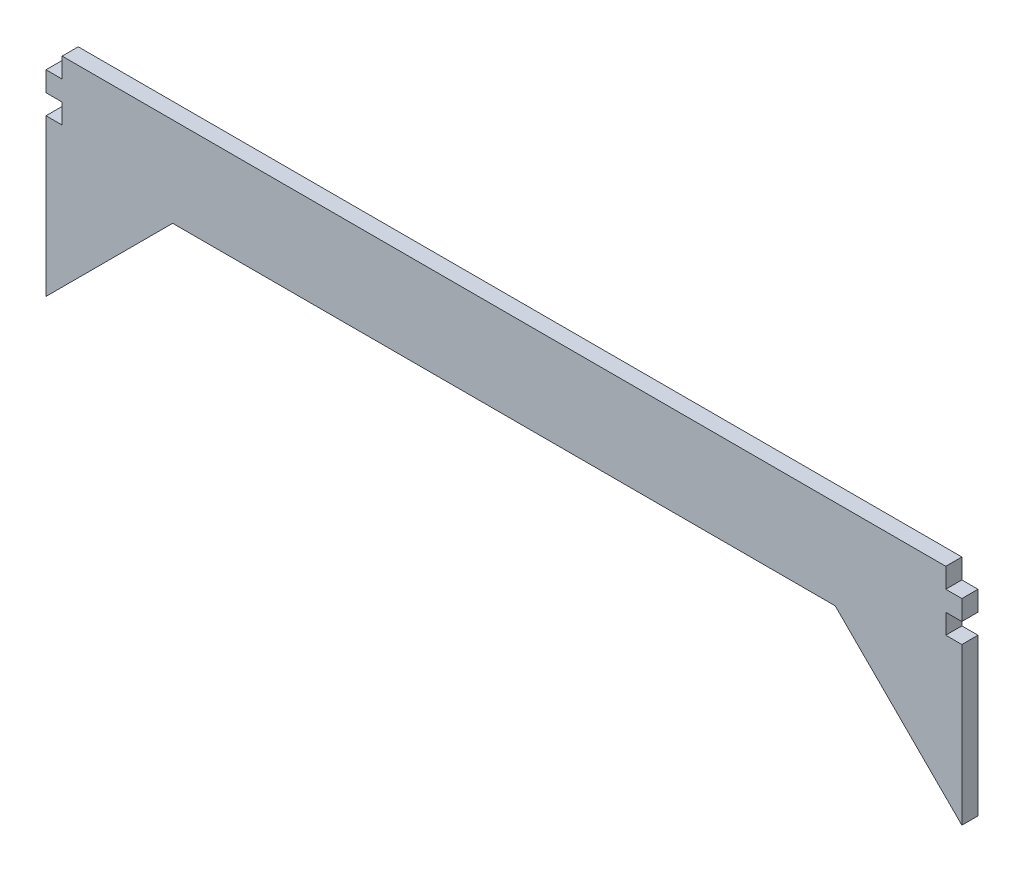
ISO-10303-21;
HEADER;
FILE_DESCRIPTION(('STEP AP214'),'2;1');
FILE_NAME('part.step','',(''),(''),'','','');
FILE_SCHEMA(('AUTOMOTIVE_DESIGN { 1 0 10303 214 1 1 1 1 }'));
ENDSEC;
DATA;
#1=APPLICATION_CONTEXT('core data for automotive mechanical design processes');
#2=APPLICATION_PROTOCOL_DEFINITION('international standard','automotive_design',2000,#1);
#3=PRODUCT_CONTEXT('',#1,'mechanical');
#4=PRODUCT('Part','Part','',(#3));
#5=PRODUCT_RELATED_PRODUCT_CATEGORY('part','',(#4));
#6=PRODUCT_DEFINITION_FORMATION('','',#4);
#7=PRODUCT_DEFINITION_CONTEXT('part definition',#1,'design');
#8=PRODUCT_DEFINITION('design','',#6,#7);
#9=PRODUCT_DEFINITION_SHAPE('','',#8);
#10=(LENGTH_UNIT() NAMED_UNIT(*) SI_UNIT(.MILLI.,.METRE.));
#11=(NAMED_UNIT(*) PLANE_ANGLE_UNIT() SI_UNIT($,.RADIAN.));
#12=(NAMED_UNIT(*) SI_UNIT($,.STERADIAN.) SOLID_ANGLE_UNIT());
#13=UNCERTAINTY_MEASURE_WITH_UNIT(LENGTH_MEASURE(1.E-05),#10,'distance_accuracy_value','');
#14=(GEOMETRIC_REPRESENTATION_CONTEXT(3) GLOBAL_UNCERTAINTY_ASSIGNED_CONTEXT((#13)) GLOBAL_UNIT_ASSIGNED_CONTEXT((#10,
#11,#12)) REPRESENTATION_CONTEXT('',''));
#15=CARTESIAN_POINT('',(0.,0.,0.));
#16=DIRECTION('',(0.,0.,1.));
#17=DIRECTION('',(1.,0.,0.));
#18=AXIS2_PLACEMENT_3D('',#15,#16,#17);
#19=CARTESIAN_POINT('',(76.7,-10.,2.7));
#20=DIRECTION('',(-1.,0.,0.));
#21=DIRECTION('',(0.,0.,1.));
#22=AXIS2_PLACEMENT_3D('',#19,#20,#21);
#23=PLANE('',#22);
#24=DIRECTION('',(0.,1.,0.));
#25=VECTOR('',#24,1.);
#26=CARTESIAN_POINT('',(76.7,-10.,0.));
#27=LINE('',#26,#25);
#28=CARTESIAN_POINT('',(76.7,-31.2132034355964,0.));
#29=VERTEX_POINT('',#28);
#30=CARTESIAN_POINT('',(76.7,-5.,0.));
#31=VERTEX_POINT('',#30);
#32=EDGE_CURVE('E115',#29,#31,#27,.T.);
#33=ORIENTED_EDGE('',*,*,#32,.T.);
#34=DIRECTION('',(0.,0.,-1.));
#35=VECTOR('',#34,1.);
#36=CARTESIAN_POINT('',(76.7,-5.,2.7));
#37=LINE('',#36,#35);
#38=CARTESIAN_POINT('',(76.7,-5.,2.7));
#39=VERTEX_POINT('',#38);
#40=EDGE_CURVE('E11',#39,#31,#37,.T.);
#41=ORIENTED_EDGE('',*,*,#40,.F.);
#42=DIRECTION('',(0.,1.,0.));
#43=VECTOR('',#42,1.);
#44=CARTESIAN_POINT('',(76.7,-31.2132034355964,2.7));
#45=LINE('',#44,#43);
#46=CARTESIAN_POINT('',(76.7,-31.2132034355964,2.7));
#47=VERTEX_POINT('',#46);
#48=EDGE_CURVE('E121',#47,#39,#45,.T.);
#49=ORIENTED_EDGE('',*,*,#48,.F.);
#50=DIRECTION('',(0.,0.,-1.));
#51=VECTOR('',#50,1.);
#52=CARTESIAN_POINT('',(76.7,-31.2132034355964,2.7));
#53=LINE('',#52,#51);
#54=EDGE_CURVE('E185',#47,#29,#53,.T.);
#55=ORIENTED_EDGE('',*,*,#54,.T.);
#56=EDGE_LOOP('',(#33,#41,#49,#55));
#57=FACE_BOUND('',#56,.T.);
#58=ADVANCED_FACE('F33',(#57),#23,.F.);
#59=CARTESIAN_POINT('',(76.7,-5.,2.7));
#60=DIRECTION('',(0.,-1.,0.));
#61=DIRECTION('',(0.,0.,-1.));
#62=AXIS2_PLACEMENT_3D('',#59,#60,#61);
#63=PLANE('',#62);
#64=DIRECTION('',(-1.,0.,0.));
#65=VECTOR('',#64,1.);
#66=CARTESIAN_POINT('',(76.7,-5.,0.));
#67=LINE('',#66,#65);
#68=CARTESIAN_POINT('',(74.,-5.,0.));
#69=VERTEX_POINT('',#68);
#70=EDGE_CURVE('E190',#31,#69,#67,.T.);
#71=ORIENTED_EDGE('',*,*,#70,.T.);
#72=DIRECTION('',(0.,0.,-1.));
#73=VECTOR('',#72,1.);
#74=CARTESIAN_POINT('',(74.,-5.,2.7));
#75=LINE('',#74,#73);
#76=CARTESIAN_POINT('',(74.,-5.,2.7));
#77=VERTEX_POINT('',#76);
#78=EDGE_CURVE('E41',#77,#69,#75,.T.);
#79=ORIENTED_EDGE('',*,*,#78,.F.);
#80=DIRECTION('',(-1.,0.,0.));
#81=VECTOR('',#80,1.);
#82=CARTESIAN_POINT('',(76.7,-5.,2.7));
#83=LINE('',#82,#81);
#84=EDGE_CURVE('E320',#39,#77,#83,.T.);
#85=ORIENTED_EDGE('',*,*,#84,.F.);
#86=ORIENTED_EDGE('',*,*,#40,.T.);
#87=EDGE_LOOP('',(#71,#79,#85,#86));
#88=FACE_BOUND('',#87,.T.);
#89=ADVANCED_FACE('F323',(#88),#63,.F.);
#90=CARTESIAN_POINT('',(74.,-1.66666666666667,2.7));
#91=DIRECTION('',(-1.,0.,0.));
#92=DIRECTION('',(0.,0.,1.));
#93=AXIS2_PLACEMENT_3D('',#90,#91,#92);
#94=PLANE('',#93);
#95=DIRECTION('',(0.,1.,0.));
#96=VECTOR('',#95,1.);
#97=CARTESIAN_POINT('',(74.,-1.66666666666667,0.));
#98=LINE('',#97,#96);
#99=CARTESIAN_POINT('',(74.,-1.66666666666667,0.));
#100=VERTEX_POINT('',#99);
#101=EDGE_CURVE('E192',#69,#100,#98,.T.);
#102=ORIENTED_EDGE('',*,*,#101,.T.);
#103=DIRECTION('',(0.,0.,-1.));
#104=VECTOR('',#103,1.);
#105=CARTESIAN_POINT('',(74.,-1.66666666666667,2.7));
#106=LINE('',#105,#104);
#107=CARTESIAN_POINT('',(74.,-1.66666666666667,2.7));
#108=VERTEX_POINT('',#107);
#109=EDGE_CURVE('E260',#108,#100,#106,.T.);
#110=ORIENTED_EDGE('',*,*,#109,.F.);
#111=DIRECTION('',(0.,1.,0.));
#112=VECTOR('',#111,1.);
#113=CARTESIAN_POINT('',(74.,-1.66666666666667,2.7));
#114=LINE('',#113,#112);
#115=EDGE_CURVE('E269',#77,#108,#114,.T.);
#116=ORIENTED_EDGE('',*,*,#115,.F.);
#117=ORIENTED_EDGE('',*,*,#78,.T.);
#118=EDGE_LOOP('',(#102,#110,#116,#117));
#119=FACE_BOUND('',#118,.T.);
#120=ADVANCED_FACE('F267',(#119),#94,.F.);
#121=CARTESIAN_POINT('',(76.7,-1.66666666666667,2.7));
#122=DIRECTION('',(0.,1.,0.));
#123=DIRECTION('',(-1.,0.,0.));
#124=AXIS2_PLACEMENT_3D('',#121,#122,#123);
#125=PLANE('',#124);
#126=DIRECTION('',(1.,0.,0.));
#127=VECTOR('',#126,1.);
#128=CARTESIAN_POINT('',(76.7,-1.66666666666667,0.));
#129=LINE('',#128,#127);
#130=CARTESIAN_POINT('',(76.7,-1.66666666666667,0.));
#131=VERTEX_POINT('',#130);
#132=EDGE_CURVE('E194',#100,#131,#129,.T.);
#133=ORIENTED_EDGE('',*,*,#132,.T.);
#134=DIRECTION('',(0.,0.,-1.));
#135=VECTOR('',#134,1.);
#136=CARTESIAN_POINT('',(76.7,-1.66666666666667,2.7));
#137=LINE('',#136,#135);
#138=CARTESIAN_POINT('',(76.7,-1.66666666666667,2.7));
#139=VERTEX_POINT('',#138);
#140=EDGE_CURVE('E257',#139,#131,#137,.T.);
#141=ORIENTED_EDGE('',*,*,#140,.F.);
#142=DIRECTION('',(1.,0.,0.));
#143=VECTOR('',#142,1.);
#144=CARTESIAN_POINT('',(76.7,-1.66666666666667,2.7));
#145=LINE('',#144,#143);
#146=EDGE_CURVE('E287',#108,#139,#145,.T.);
#147=ORIENTED_EDGE('',*,*,#146,.F.);
#148=ORIENTED_EDGE('',*,*,#109,.T.);
#149=EDGE_LOOP('',(#133,#141,#147,#148));
#150=FACE_BOUND('',#149,.T.);
#151=ADVANCED_FACE('F278',(#150),#125,.F.);
#152=CARTESIAN_POINT('',(76.7,-1.66666666666667,2.7));
#153=DIRECTION('',(-1.,0.,0.));
#154=DIRECTION('',(0.,0.,1.));
#155=AXIS2_PLACEMENT_3D('',#152,#153,#154);
#156=PLANE('',#155);
#157=DIRECTION('',(0.,1.,0.));
#158=VECTOR('',#157,1.);
#159=CARTESIAN_POINT('',(76.7,-1.66666666666667,0.));
#160=LINE('',#159,#158);
#161=CARTESIAN_POINT('',(76.7,1.66666666666667,0.));
#162=VERTEX_POINT('',#161);
#163=EDGE_CURVE('E196',#131,#162,#160,.T.);
#164=ORIENTED_EDGE('',*,*,#163,.T.);
#165=DIRECTION('',(0.,0.,-1.));
#166=VECTOR('',#165,1.);
#167=CARTESIAN_POINT('',(76.7,1.66666666666667,2.7));
#168=LINE('',#167,#166);
#169=CARTESIAN_POINT('',(76.7,1.66666666666667,2.7));
#170=VERTEX_POINT('',#169);
#171=EDGE_CURVE('E254',#170,#162,#168,.T.);
#172=ORIENTED_EDGE('',*,*,#171,.F.);
#173=DIRECTION('',(0.,1.,0.));
#174=VECTOR('',#173,1.);
#175=CARTESIAN_POINT('',(76.7,-1.66666666666667,2.7));
#176=LINE('',#175,#174);
#177=EDGE_CURVE('E284',#139,#170,#176,.T.);
#178=ORIENTED_EDGE('',*,*,#177,.F.);
#179=ORIENTED_EDGE('',*,*,#140,.T.);
#180=EDGE_LOOP('',(#164,#172,#178,#179));
#181=FACE_BOUND('',#180,.T.);
#182=ADVANCED_FACE('F282',(#181),#156,.F.);
#183=CARTESIAN_POINT('',(76.7,1.66666666666667,2.7));
#184=DIRECTION('',(0.,-1.,0.));
#185=DIRECTION('',(1.,0.,0.));
#186=AXIS2_PLACEMENT_3D('',#183,#184,#185);
#187=PLANE('',#186);
#188=DIRECTION('',(-1.,0.,0.));
#189=VECTOR('',#188,1.);
#190=CARTESIAN_POINT('',(76.7,1.66666666666667,0.));
#191=LINE('',#190,#189);
#192=CARTESIAN_POINT('',(74.,1.66666666666667,0.));
#193=VERTEX_POINT('',#192);
#194=EDGE_CURVE('E198',#162,#193,#191,.T.);
#195=ORIENTED_EDGE('',*,*,#194,.T.);
#196=DIRECTION('',(0.,0.,-1.));
#197=VECTOR('',#196,1.);
#198=CARTESIAN_POINT('',(74.,1.66666666666667,2.7));
#199=LINE('',#198,#197);
#200=CARTESIAN_POINT('',(74.,1.66666666666667,2.7));
#201=VERTEX_POINT('',#200);
#202=EDGE_CURVE('E251',#201,#193,#199,.T.);
#203=ORIENTED_EDGE('',*,*,#202,.F.);
#204=DIRECTION('',(-1.,0.,0.));
#205=VECTOR('',#204,1.);
#206=CARTESIAN_POINT('',(76.7,1.66666666666667,2.7));
#207=LINE('',#206,#205);
#208=EDGE_CURVE('E286',#170,#201,#207,.T.);
#209=ORIENTED_EDGE('',*,*,#208,.F.);
#210=ORIENTED_EDGE('',*,*,#171,.T.);
#211=EDGE_LOOP('',(#195,#203,#209,#210));
#212=FACE_BOUND('',#211,.T.);
#213=ADVANCED_FACE('F335',(#212),#187,.F.);
#214=CARTESIAN_POINT('',(74.,1.66666666666667,2.7));
#215=DIRECTION('',(-1.,0.,0.));
#216=DIRECTION('',(0.,0.,1.));
#217=AXIS2_PLACEMENT_3D('',#214,#215,#216);
#218=PLANE('',#217);
#219=DIRECTION('',(0.,1.,0.));
#220=VECTOR('',#219,1.);
#221=CARTESIAN_POINT('',(74.,1.66666666666667,0.));
#222=LINE('',#221,#220);
#223=CARTESIAN_POINT('',(74.,5.,0.));
#224=VERTEX_POINT('',#223);
#225=EDGE_CURVE('E200',#193,#224,#222,.T.);
#226=ORIENTED_EDGE('',*,*,#225,.T.);
#227=DIRECTION('',(0.,0.,-1.));
#228=VECTOR('',#227,1.);
#229=CARTESIAN_POINT('',(74.,5.,2.7));
#230=LINE('',#229,#228);
#231=CARTESIAN_POINT('',(74.,5.,2.7));
#232=VERTEX_POINT('',#231);
#233=EDGE_CURVE('E248',#232,#224,#230,.T.);
#234=ORIENTED_EDGE('',*,*,#233,.F.);
#235=DIRECTION('',(0.,1.,0.));
#236=VECTOR('',#235,1.);
#237=CARTESIAN_POINT('',(74.,1.66666666666667,2.7));
#238=LINE('',#237,#236);
#239=EDGE_CURVE('E289',#201,#232,#238,.T.);
#240=ORIENTED_EDGE('',*,*,#239,.F.);
#241=ORIENTED_EDGE('',*,*,#202,.T.);
#242=EDGE_LOOP('',(#226,#234,#240,#241));
#243=FACE_BOUND('',#242,.T.);
#244=ADVANCED_FACE('F338',(#243),#218,.F.);
#245=CARTESIAN_POINT('',(74.,5.,2.7));
#246=DIRECTION('',(0.,-1.,0.));
#247=DIRECTION('',(1.,0.,0.));
#248=AXIS2_PLACEMENT_3D('',#245,#246,#247);
#249=PLANE('',#248);
#250=DIRECTION('',(-1.,0.,0.));
#251=VECTOR('',#250,1.);
#252=CARTESIAN_POINT('',(74.,5.,0.));
#253=LINE('',#252,#251);
#254=CARTESIAN_POINT('',(-74.,4.99999999999999,0.));
#255=VERTEX_POINT('',#254);
#256=EDGE_CURVE('E202',#224,#255,#253,.T.);
#257=ORIENTED_EDGE('',*,*,#256,.T.);
#258=DIRECTION('',(0.,0.,-1.));
#259=VECTOR('',#258,1.);
#260=CARTESIAN_POINT('',(-74.,4.99999999999999,2.7));
#261=LINE('',#260,#259);
#262=CARTESIAN_POINT('',(-74.,4.99999999999999,2.7));
#263=VERTEX_POINT('',#262);
#264=EDGE_CURVE('E245',#263,#255,#261,.T.);
#265=ORIENTED_EDGE('',*,*,#264,.F.);
#266=DIRECTION('',(-1.,0.,0.));
#267=VECTOR('',#266,1.);
#268=CARTESIAN_POINT('',(74.,5.,2.7));
#269=LINE('',#268,#267);
#270=EDGE_CURVE('E295',#232,#263,#269,.T.);
#271=ORIENTED_EDGE('',*,*,#270,.F.);
#272=ORIENTED_EDGE('',*,*,#233,.T.);
#273=EDGE_LOOP('',(#257,#265,#271,#272));
#274=FACE_BOUND('',#273,.T.);
#275=ADVANCED_FACE('F342',(#274),#249,.F.);
#276=CARTESIAN_POINT('',(-74.,1.66666666666665,2.7));
#277=DIRECTION('',(1.,0.,0.));
#278=DIRECTION('',(0.,0.,-1.));
#279=AXIS2_PLACEMENT_3D('',#276,#277,#278);
#280=PLANE('',#279);
#281=DIRECTION('',(0.,-1.,0.));
#282=VECTOR('',#281,1.);
#283=CARTESIAN_POINT('',(-74.,1.66666666666665,0.));
#284=LINE('',#283,#282);
#285=CARTESIAN_POINT('',(-74.,1.66666666666665,0.));
#286=VERTEX_POINT('',#285);
#287=EDGE_CURVE('E204',#255,#286,#284,.T.);
#288=ORIENTED_EDGE('',*,*,#287,.T.);
#289=DIRECTION('',(0.,0.,-1.));
#290=VECTOR('',#289,1.);
#291=CARTESIAN_POINT('',(-74.,1.66666666666665,2.7));
#292=LINE('',#291,#290);
#293=CARTESIAN_POINT('',(-74.,1.66666666666665,2.7));
#294=VERTEX_POINT('',#293);
#295=EDGE_CURVE('E242',#294,#286,#292,.T.);
#296=ORIENTED_EDGE('',*,*,#295,.F.);
#297=DIRECTION('',(0.,-1.,0.));
#298=VECTOR('',#297,1.);
#299=CARTESIAN_POINT('',(-74.,1.66666666666665,2.7));
#300=LINE('',#299,#298);
#301=EDGE_CURVE('E297',#263,#294,#300,.T.);
#302=ORIENTED_EDGE('',*,*,#301,.F.);
#303=ORIENTED_EDGE('',*,*,#264,.T.);
#304=EDGE_LOOP('',(#288,#296,#302,#303));
#305=FACE_BOUND('',#304,.T.);
#306=ADVANCED_FACE('F346',(#305),#280,.F.);
#307=CARTESIAN_POINT('',(-76.7,1.66666666666665,2.7));
#308=DIRECTION('',(0.,-1.,0.));
#309=DIRECTION('',(1.,0.,0.));
#310=AXIS2_PLACEMENT_3D('',#307,#308,#309);
#311=PLANE('',#310);
#312=DIRECTION('',(-1.,0.,0.));
#313=VECTOR('',#312,1.);
#314=CARTESIAN_POINT('',(-76.7,1.66666666666665,0.));
#315=LINE('',#314,#313);
#316=CARTESIAN_POINT('',(-76.7,1.66666666666665,0.));
#317=VERTEX_POINT('',#316);
#318=EDGE_CURVE('E206',#286,#317,#315,.T.);
#319=ORIENTED_EDGE('',*,*,#318,.T.);
#320=DIRECTION('',(0.,0.,-1.));
#321=VECTOR('',#320,1.);
#322=CARTESIAN_POINT('',(-76.7,1.66666666666665,2.7));
#323=LINE('',#322,#321);
#324=CARTESIAN_POINT('',(-76.7,1.66666666666665,2.7));
#325=VERTEX_POINT('',#324);
#326=EDGE_CURVE('E239',#325,#317,#323,.T.);
#327=ORIENTED_EDGE('',*,*,#326,.F.);
#328=DIRECTION('',(-1.,0.,0.));
#329=VECTOR('',#328,1.);
#330=CARTESIAN_POINT('',(-76.7,1.66666666666665,2.7));
#331=LINE('',#330,#329);
#332=EDGE_CURVE('E299',#294,#325,#331,.T.);
#333=ORIENTED_EDGE('',*,*,#332,.F.);
#334=ORIENTED_EDGE('',*,*,#295,.T.);
#335=EDGE_LOOP('',(#319,#327,#333,#334));
#336=FACE_BOUND('',#335,.T.);
#337=ADVANCED_FACE('F350',(#336),#311,.F.);
#338=CARTESIAN_POINT('',(-76.7,-1.66666666666668,2.7));
#339=DIRECTION('',(1.,0.,0.));
#340=DIRECTION('',(0.,0.,-1.));
#341=AXIS2_PLACEMENT_3D('',#338,#339,#340);
#342=PLANE('',#341);
#343=DIRECTION('',(0.,-1.,0.));
#344=VECTOR('',#343,1.);
#345=CARTESIAN_POINT('',(-76.7,-1.66666666666668,0.));
#346=LINE('',#345,#344);
#347=CARTESIAN_POINT('',(-76.7,-1.66666666666668,0.));
#348=VERTEX_POINT('',#347);
#349=EDGE_CURVE('E208',#317,#348,#346,.T.);
#350=ORIENTED_EDGE('',*,*,#349,.T.);
#351=DIRECTION('',(0.,0.,-1.));
#352=VECTOR('',#351,1.);
#353=CARTESIAN_POINT('',(-76.7,-1.66666666666668,2.7));
#354=LINE('',#353,#352);
#355=CARTESIAN_POINT('',(-76.7,-1.66666666666668,2.7));
#356=VERTEX_POINT('',#355);
#357=EDGE_CURVE('E236',#356,#348,#354,.T.);
#358=ORIENTED_EDGE('',*,*,#357,.F.);
#359=DIRECTION('',(0.,-1.,0.));
#360=VECTOR('',#359,1.);
#361=CARTESIAN_POINT('',(-76.7,-1.66666666666668,2.7));
#362=LINE('',#361,#360);
#363=EDGE_CURVE('E301',#325,#356,#362,.T.);
#364=ORIENTED_EDGE('',*,*,#363,.F.);
#365=ORIENTED_EDGE('',*,*,#326,.T.);
#366=EDGE_LOOP('',(#350,#358,#364,#365));
#367=FACE_BOUND('',#366,.T.);
#368=ADVANCED_FACE('F354',(#367),#342,.F.);
#369=CARTESIAN_POINT('',(-76.7,-1.66666666666668,2.7));
#370=DIRECTION('',(0.,1.,0.));
#371=DIRECTION('',(0.,0.,1.));
#372=AXIS2_PLACEMENT_3D('',#369,#370,#371);
#373=PLANE('',#372);
#374=DIRECTION('',(1.,0.,0.));
#375=VECTOR('',#374,1.);
#376=CARTESIAN_POINT('',(-76.7,-1.66666666666668,0.));
#377=LINE('',#376,#375);
#378=CARTESIAN_POINT('',(-74.,-1.66666666666668,0.));
#379=VERTEX_POINT('',#378);
#380=EDGE_CURVE('E210',#348,#379,#377,.T.);
#381=ORIENTED_EDGE('',*,*,#380,.T.);
#382=DIRECTION('',(0.,0.,-1.));
#383=VECTOR('',#382,1.);
#384=CARTESIAN_POINT('',(-74.,-1.66666666666668,2.7));
#385=LINE('',#384,#383);
#386=CARTESIAN_POINT('',(-74.,-1.66666666666668,2.7));
#387=VERTEX_POINT('',#386);
#388=EDGE_CURVE('E233',#387,#379,#385,.T.);
#389=ORIENTED_EDGE('',*,*,#388,.F.);
#390=DIRECTION('',(1.,0.,0.));
#391=VECTOR('',#390,1.);
#392=CARTESIAN_POINT('',(-76.7,-1.66666666666668,2.7));
#393=LINE('',#392,#391);
#394=EDGE_CURVE('E303',#356,#387,#393,.T.);
#395=ORIENTED_EDGE('',*,*,#394,.F.);
#396=ORIENTED_EDGE('',*,*,#357,.T.);
#397=EDGE_LOOP('',(#381,#389,#395,#396));
#398=FACE_BOUND('',#397,.T.);
#399=ADVANCED_FACE('F358',(#398),#373,.F.);
#400=CARTESIAN_POINT('',(-74.,-1.66666666666668,2.7));
#401=DIRECTION('',(1.,0.,0.));
#402=DIRECTION('',(0.,0.,-1.));
#403=AXIS2_PLACEMENT_3D('',#400,#401,#402);
#404=PLANE('',#403);
#405=DIRECTION('',(0.,-1.,0.));
#406=VECTOR('',#405,1.);
#407=CARTESIAN_POINT('',(-74.,-1.66666666666668,0.));
#408=LINE('',#407,#406);
#409=CARTESIAN_POINT('',(-74.,-5.00000000000002,0.));
#410=VERTEX_POINT('',#409);
#411=EDGE_CURVE('E212',#379,#410,#408,.T.);
#412=ORIENTED_EDGE('',*,*,#411,.T.);
#413=DIRECTION('',(0.,0.,-1.));
#414=VECTOR('',#413,1.);
#415=CARTESIAN_POINT('',(-74.,-5.00000000000002,2.7));
#416=LINE('',#415,#414);
#417=CARTESIAN_POINT('',(-74.,-5.00000000000002,2.7));
#418=VERTEX_POINT('',#417);
#419=EDGE_CURVE('E230',#418,#410,#416,.T.);
#420=ORIENTED_EDGE('',*,*,#419,.F.);
#421=DIRECTION('',(0.,-1.,0.));
#422=VECTOR('',#421,1.);
#423=CARTESIAN_POINT('',(-74.,-1.66666666666668,2.7));
#424=LINE('',#423,#422);
#425=EDGE_CURVE('E305',#387,#418,#424,.T.);
#426=ORIENTED_EDGE('',*,*,#425,.F.);
#427=ORIENTED_EDGE('',*,*,#388,.T.);
#428=EDGE_LOOP('',(#412,#420,#426,#427));
#429=FACE_BOUND('',#428,.T.);
#430=ADVANCED_FACE('F362',(#429),#404,.F.);
#431=CARTESIAN_POINT('',(-74.,-5.00000000000002,2.7));
#432=DIRECTION('',(0.,-1.,0.));
#433=DIRECTION('',(0.,0.,-1.));
#434=AXIS2_PLACEMENT_3D('',#431,#432,#433);
#435=PLANE('',#434);
#436=DIRECTION('',(-1.,0.,0.));
#437=VECTOR('',#436,1.);
#438=CARTESIAN_POINT('',(-74.,-5.00000000000002,0.));
#439=LINE('',#438,#437);
#440=CARTESIAN_POINT('',(-76.7,-5.00000000000002,0.));
#441=VERTEX_POINT('',#440);
#442=EDGE_CURVE('E214',#410,#441,#439,.T.);
#443=ORIENTED_EDGE('',*,*,#442,.T.);
#444=DIRECTION('',(0.,0.,-1.));
#445=VECTOR('',#444,1.);
#446=CARTESIAN_POINT('',(-76.7,-5.00000000000002,2.7));
#447=LINE('',#446,#445);
#448=CARTESIAN_POINT('',(-76.7,-5.00000000000002,2.7));
#449=VERTEX_POINT('',#448);
#450=EDGE_CURVE('E227',#449,#441,#447,.T.);
#451=ORIENTED_EDGE('',*,*,#450,.F.);
#452=DIRECTION('',(-1.,0.,0.));
#453=VECTOR('',#452,1.);
#454=CARTESIAN_POINT('',(-74.,-5.00000000000002,2.7));
#455=LINE('',#454,#453);
#456=EDGE_CURVE('E307',#418,#449,#455,.T.);
#457=ORIENTED_EDGE('',*,*,#456,.F.);
#458=ORIENTED_EDGE('',*,*,#419,.T.);
#459=EDGE_LOOP('',(#443,#451,#457,#458));
#460=FACE_BOUND('',#459,.T.);
#461=ADVANCED_FACE('F313',(#460),#435,.F.);
#462=CARTESIAN_POINT('',(-76.7,-31.2132034355964,2.7));
#463=DIRECTION('',(1.,0.,0.));
#464=DIRECTION('',(0.,1.,0.));
#465=AXIS2_PLACEMENT_3D('',#462,#463,#464);
#466=PLANE('',#465);
#467=DIRECTION('',(0.,-1.,0.));
#468=VECTOR('',#467,1.);
#469=CARTESIAN_POINT('',(-76.7,-31.2132034355964,0.));
#470=LINE('',#469,#468);
#471=CARTESIAN_POINT('',(-76.7,-31.2132034355964,0.));
#472=VERTEX_POINT('',#471);
#473=EDGE_CURVE('E217',#441,#472,#470,.T.);
#474=ORIENTED_EDGE('',*,*,#473,.T.);
#475=DIRECTION('',(0.,0.,-1.));
#476=VECTOR('',#475,1.);
#477=CARTESIAN_POINT('',(-76.7,-31.2132034355964,2.7));
#478=LINE('',#477,#476);
#479=CARTESIAN_POINT('',(-76.7,-31.2132034355964,2.7));
#480=VERTEX_POINT('',#479);
#481=EDGE_CURVE('E180',#480,#472,#478,.T.);
#482=ORIENTED_EDGE('',*,*,#481,.F.);
#483=DIRECTION('',(0.,-1.,0.));
#484=VECTOR('',#483,1.);
#485=CARTESIAN_POINT('',(-76.7,-5.00000000000002,2.7));
#486=LINE('',#485,#484);
#487=EDGE_CURVE('E171',#449,#480,#486,.T.);
#488=ORIENTED_EDGE('',*,*,#487,.F.);
#489=ORIENTED_EDGE('',*,*,#450,.T.);
#490=EDGE_LOOP('',(#474,#482,#488,#489));
#491=FACE_BOUND('',#490,.T.);
#492=ADVANCED_FACE('F316',(#491),#466,.F.);
#493=CARTESIAN_POINT('',(-55.4867965644036,-10.,2.7));
#494=DIRECTION('',(-0.707106781186547,0.707106781186548,0.));
#495=DIRECTION('',(-0.707106781186548,-0.707106781186547,0.));
#496=AXIS2_PLACEMENT_3D('',#493,#494,#495);
#497=PLANE('',#496);
#498=DIRECTION('',(0.707106781186548,0.707106781186547,0.));
#499=VECTOR('',#498,1.);
#500=CARTESIAN_POINT('',(-55.4867965644036,-10.,0.));
#501=LINE('',#500,#499);
#502=CARTESIAN_POINT('',(-55.4867965644036,-10.,0.));
#503=VERTEX_POINT('',#502);
#504=EDGE_CURVE('E179',#472,#503,#501,.T.);
#505=ORIENTED_EDGE('',*,*,#504,.T.);
#506=DIRECTION('',(0.,0.,-1.));
#507=VECTOR('',#506,1.);
#508=CARTESIAN_POINT('',(-55.4867965644036,-10.,2.7));
#509=LINE('',#508,#507);
#510=CARTESIAN_POINT('',(-55.4867965644036,-10.,2.7));
#511=VERTEX_POINT('',#510);
#512=EDGE_CURVE('E176',#511,#503,#509,.T.);
#513=ORIENTED_EDGE('',*,*,#512,.F.);
#514=DIRECTION('',(0.707106781186548,0.707106781186547,0.));
#515=VECTOR('',#514,1.);
#516=CARTESIAN_POINT('',(-55.4867965644036,-10.,2.7));
#517=LINE('',#516,#515);
#518=EDGE_CURVE('E165',#480,#511,#517,.T.);
#519=ORIENTED_EDGE('',*,*,#518,.F.);
#520=ORIENTED_EDGE('',*,*,#481,.T.);
#521=EDGE_LOOP('',(#505,#513,#519,#520));
#522=FACE_BOUND('',#521,.T.);
#523=ADVANCED_FACE('F177',(#522),#497,.F.);
#524=CARTESIAN_POINT('',(-55.4867965644036,-10.,2.7));
#525=DIRECTION('',(0.,1.,0.));
#526=DIRECTION('',(0.,0.,1.));
#527=AXIS2_PLACEMENT_3D('',#524,#525,#526);
#528=PLANE('',#527);
#529=DIRECTION('',(1.,0.,0.));
#530=VECTOR('',#529,1.);
#531=CARTESIAN_POINT('',(-55.4867965644036,-10.,0.));
#532=LINE('',#531,#530);
#533=CARTESIAN_POINT('',(55.4867965644036,-10.,0.));
#534=VERTEX_POINT('',#533);
#535=EDGE_CURVE('E108',#503,#534,#532,.T.);
#536=ORIENTED_EDGE('',*,*,#535,.T.);
#537=DIRECTION('',(0.,0.,-1.));
#538=VECTOR('',#537,1.);
#539=CARTESIAN_POINT('',(55.4867965644036,-10.,2.7));
#540=LINE('',#539,#538);
#541=CARTESIAN_POINT('',(55.4867965644036,-10.,2.7));
#542=VERTEX_POINT('',#541);
#543=EDGE_CURVE('E181',#542,#534,#540,.T.);
#544=ORIENTED_EDGE('',*,*,#543,.F.);
#545=DIRECTION('',(1.,0.,0.));
#546=VECTOR('',#545,1.);
#547=CARTESIAN_POINT('',(-55.4867965644036,-10.,2.7));
#548=LINE('',#547,#546);
#549=EDGE_CURVE('E169',#511,#542,#548,.T.);
#550=ORIENTED_EDGE('',*,*,#549,.F.);
#551=ORIENTED_EDGE('',*,*,#512,.T.);
#552=EDGE_LOOP('',(#536,#544,#550,#551));
#553=FACE_BOUND('',#552,.T.);
#554=ADVANCED_FACE('F183',(#553),#528,.F.);
#555=CARTESIAN_POINT('',(55.4867965644036,-10.,2.7));
#556=DIRECTION('',(0.707106781186547,0.707106781186548,0.));
#557=DIRECTION('',(-0.707106781186548,0.707106781186547,0.));
#558=AXIS2_PLACEMENT_3D('',#555,#556,#557);
#559=PLANE('',#558);
#560=DIRECTION('',(0.707106781186548,-0.707106781186547,0.));
#561=VECTOR('',#560,1.);
#562=CARTESIAN_POINT('',(55.4867965644036,-10.,0.));
#563=LINE('',#562,#561);
#564=EDGE_CURVE('E221',#534,#29,#563,.T.);
#565=ORIENTED_EDGE('',*,*,#564,.T.);
#566=ORIENTED_EDGE('',*,*,#54,.F.);
#567=DIRECTION('',(0.707106781186548,-0.707106781186547,0.));
#568=VECTOR('',#567,1.);
#569=CARTESIAN_POINT('',(55.4867965644036,-10.,2.7));
#570=LINE('',#569,#568);
#571=EDGE_CURVE('E49',#542,#47,#570,.T.);
#572=ORIENTED_EDGE('',*,*,#571,.F.);
#573=ORIENTED_EDGE('',*,*,#543,.T.);
#574=EDGE_LOOP('',(#565,#566,#572,#573));
#575=FACE_BOUND('',#574,.T.);
#576=ADVANCED_FACE('F318',(#575),#559,.F.);
#577=CARTESIAN_POINT('',(0.,0.,2.7));
#578=DIRECTION('',(0.,0.,1.));
#579=DIRECTION('',(1.,0.,0.));
#580=AXIS2_PLACEMENT_3D('',#577,#578,#579);
#581=PLANE('',#580);
#582=ORIENTED_EDGE('',*,*,#48,.T.);
#583=ORIENTED_EDGE('',*,*,#84,.T.);
#584=ORIENTED_EDGE('',*,*,#115,.T.);
#585=ORIENTED_EDGE('',*,*,#146,.T.);
#586=ORIENTED_EDGE('',*,*,#177,.T.);
#587=ORIENTED_EDGE('',*,*,#208,.T.);
#588=ORIENTED_EDGE('',*,*,#239,.T.);
#589=ORIENTED_EDGE('',*,*,#270,.T.);
#590=ORIENTED_EDGE('',*,*,#301,.T.);
#591=ORIENTED_EDGE('',*,*,#332,.T.);
#592=ORIENTED_EDGE('',*,*,#363,.T.);
#593=ORIENTED_EDGE('',*,*,#394,.T.);
#594=ORIENTED_EDGE('',*,*,#425,.T.);
#595=ORIENTED_EDGE('',*,*,#456,.T.);
#596=ORIENTED_EDGE('',*,*,#487,.T.);
#597=ORIENTED_EDGE('',*,*,#518,.T.);
#598=ORIENTED_EDGE('',*,*,#549,.T.);
#599=ORIENTED_EDGE('',*,*,#571,.T.);
#600=EDGE_LOOP('',(#582,#583,#584,#585,#586,#587,#588,#589,#590,#591,#592,#593,#594,#595,#596,
#597,#598,#599));
#601=FACE_BOUND('',#600,.T.);
#602=ADVANCED_FACE('F167',(#601),#581,.T.);
#603=CARTESIAN_POINT('',(0.,0.,0.));
#604=DIRECTION('',(0.,0.,1.));
#605=DIRECTION('',(1.,0.,0.));
#606=AXIS2_PLACEMENT_3D('',#603,#604,#605);
#607=PLANE('',#606);
#608=ORIENTED_EDGE('',*,*,#32,.F.);
#609=ORIENTED_EDGE('',*,*,#564,.F.);
#610=ORIENTED_EDGE('',*,*,#535,.F.);
#611=ORIENTED_EDGE('',*,*,#504,.F.);
#612=ORIENTED_EDGE('',*,*,#473,.F.);
#613=ORIENTED_EDGE('',*,*,#442,.F.);
#614=ORIENTED_EDGE('',*,*,#411,.F.);
#615=ORIENTED_EDGE('',*,*,#380,.F.);
#616=ORIENTED_EDGE('',*,*,#349,.F.);
#617=ORIENTED_EDGE('',*,*,#318,.F.);
#618=ORIENTED_EDGE('',*,*,#287,.F.);
#619=ORIENTED_EDGE('',*,*,#256,.F.);
#620=ORIENTED_EDGE('',*,*,#225,.F.);
#621=ORIENTED_EDGE('',*,*,#194,.F.);
#622=ORIENTED_EDGE('',*,*,#163,.F.);
#623=ORIENTED_EDGE('',*,*,#132,.F.);
#624=ORIENTED_EDGE('',*,*,#101,.F.);
#625=ORIENTED_EDGE('',*,*,#70,.F.);
#626=EDGE_LOOP('',(#608,#609,#610,#611,#612,#613,#614,#615,#616,#617,#618,#619,#620,#621,#622,
#623,#624,#625));
#627=FACE_BOUND('',#626,.T.);
#628=ADVANCED_FACE('F273',(#627),#607,.F.);
#629=CLOSED_SHELL('',(#58,#89,#120,#151,#182,#213,#244,#275,#306,#337,#368,#399,#430,#461,#492,
#523,#554,#576,#602,#628));
#630=MANIFOLD_SOLID_BREP('B2',#629);
#631=ADVANCED_BREP_SHAPE_REPRESENTATION('',(#18,#630),#14);
#632=SHAPE_DEFINITION_REPRESENTATION(#9,#631);
ENDSEC;
END-ISO-10303-21;
